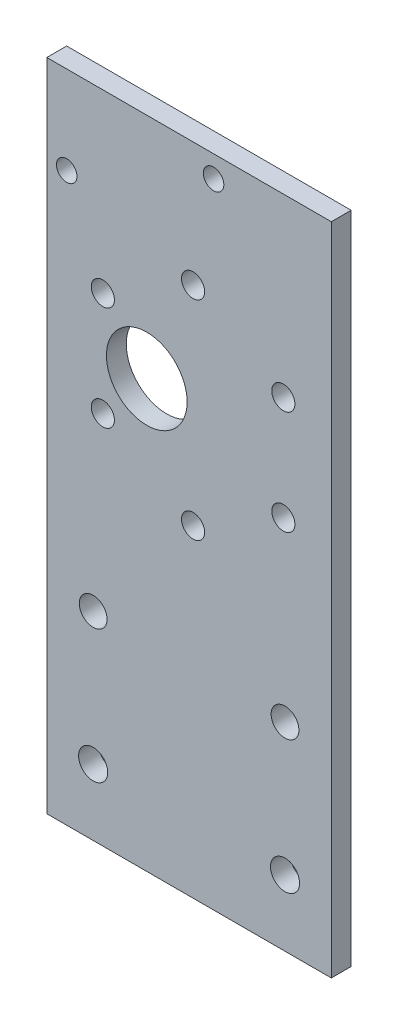
ISO-10303-21;
HEADER;
FILE_DESCRIPTION(('STEP AP214'),'2;1');
FILE_NAME('part.step','',(''),(''),'','','');
FILE_SCHEMA(('AUTOMOTIVE_DESIGN { 1 0 10303 214 1 1 1 1 }'));
ENDSEC;
DATA;
#1=APPLICATION_CONTEXT('core data for automotive mechanical design processes');
#2=APPLICATION_PROTOCOL_DEFINITION('international standard','automotive_design',2000,#1);
#3=PRODUCT_CONTEXT('',#1,'mechanical');
#4=PRODUCT('Part','Part','',(#3));
#5=PRODUCT_RELATED_PRODUCT_CATEGORY('part','',(#4));
#6=PRODUCT_DEFINITION_FORMATION('','',#4);
#7=PRODUCT_DEFINITION_CONTEXT('part definition',#1,'design');
#8=PRODUCT_DEFINITION('design','',#6,#7);
#9=PRODUCT_DEFINITION_SHAPE('','',#8);
#10=(LENGTH_UNIT() NAMED_UNIT(*) SI_UNIT(.MILLI.,.METRE.));
#11=(NAMED_UNIT(*) PLANE_ANGLE_UNIT() SI_UNIT($,.RADIAN.));
#12=(NAMED_UNIT(*) SI_UNIT($,.STERADIAN.) SOLID_ANGLE_UNIT());
#13=UNCERTAINTY_MEASURE_WITH_UNIT(LENGTH_MEASURE(1.E-05),#10,'distance_accuracy_value','');
#14=(GEOMETRIC_REPRESENTATION_CONTEXT(3) GLOBAL_UNCERTAINTY_ASSIGNED_CONTEXT((#13)) GLOBAL_UNIT_ASSIGNED_CONTEXT((#10,
#11,#12)) REPRESENTATION_CONTEXT('',''));
#15=CARTESIAN_POINT('',(0.,0.,0.));
#16=DIRECTION('',(0.,0.,1.));
#17=DIRECTION('',(1.,0.,0.));
#18=AXIS2_PLACEMENT_3D('',#15,#16,#17);
#19=CARTESIAN_POINT('',(0.,0.,3.));
#20=DIRECTION('',(0.,0.,1.));
#21=DIRECTION('',(1.,0.,0.));
#22=AXIS2_PLACEMENT_3D('',#19,#20,#21);
#23=PLANE('',#22);
#24=CARTESIAN_POINT('',(24.,21.2,3.));
#25=DIRECTION('',(0.,0.,1.));
#26=DIRECTION('',(1.,0.,0.));
#27=AXIS2_PLACEMENT_3D('',#24,#25,#26);
#28=CIRCLE('',#27,1.55);
#29=CARTESIAN_POINT('',(25.55,21.2,3.));
#30=VERTEX_POINT('',#29);
#31=EDGE_CURVE('E230',#30,#30,#28,.T.);
#32=ORIENTED_EDGE('',*,*,#31,.F.);
#33=EDGE_LOOP('',(#32));
#34=FACE_BOUND('',#33,.T.);
#35=CARTESIAN_POINT('',(46.2,31.2,3.));
#36=DIRECTION('',(0.,0.,1.));
#37=DIRECTION('',(1.,0.,0.));
#38=AXIS2_PLACEMENT_3D('',#35,#36,#37);
#39=CIRCLE('',#38,1.55);
#40=CARTESIAN_POINT('',(47.75,31.2,3.));
#41=VERTEX_POINT('',#40);
#42=EDGE_CURVE('E119',#41,#41,#39,.T.);
#43=ORIENTED_EDGE('',*,*,#42,.F.);
#44=EDGE_LOOP('',(#43));
#45=FACE_BOUND('',#44,.T.);
#46=CARTESIAN_POINT('',(28.,-54.5,3.));
#47=DIRECTION('',(0.,0.,1.));
#48=DIRECTION('',(1.,0.,0.));
#49=AXIS2_PLACEMENT_3D('',#46,#47,#48);
#50=CIRCLE('',#49,2.2);
#51=CARTESIAN_POINT('',(30.2,-54.5,3.));
#52=VERTEX_POINT('',#51);
#53=EDGE_CURVE('E127',#52,#52,#50,.T.);
#54=ORIENTED_EDGE('',*,*,#53,.F.);
#55=EDGE_LOOP('',(#54));
#56=FACE_BOUND('',#55,.T.);
#57=CARTESIAN_POINT('',(57.,-54.5,3.));
#58=DIRECTION('',(0.,0.,1.));
#59=DIRECTION('',(1.,0.,0.));
#60=AXIS2_PLACEMENT_3D('',#57,#58,#59);
#61=CIRCLE('',#60,2.2);
#62=CARTESIAN_POINT('',(59.2,-54.5,3.));
#63=VERTEX_POINT('',#62);
#64=EDGE_CURVE('E126',#63,#63,#61,.T.);
#65=ORIENTED_EDGE('',*,*,#64,.F.);
#66=EDGE_LOOP('',(#65));
#67=FACE_BOUND('',#66,.T.);
#68=DIRECTION('',(0.,-1.,0.));
#69=VECTOR('',#68,1.);
#70=CARTESIAN_POINT('',(64.,24.5,3.));
#71=LINE('',#70,#69);
#72=CARTESIAN_POINT('',(64.,34.5,3.));
#73=VERTEX_POINT('',#72);
#74=CARTESIAN_POINT('',(64.,-64.5,3.));
#75=VERTEX_POINT('',#74);
#76=EDGE_CURVE('E12',#73,#75,#71,.T.);
#77=ORIENTED_EDGE('',*,*,#76,.F.);
#78=DIRECTION('',(1.,0.,0.));
#79=VECTOR('',#78,1.);
#80=CARTESIAN_POINT('',(21.,34.5,3.));
#81=LINE('',#80,#79);
#82=CARTESIAN_POINT('',(21.,34.5,3.));
#83=VERTEX_POINT('',#82);
#84=EDGE_CURVE('E102',#83,#73,#81,.T.);
#85=ORIENTED_EDGE('',*,*,#84,.F.);
#86=DIRECTION('',(0.,1.,0.));
#87=VECTOR('',#86,1.);
#88=CARTESIAN_POINT('',(21.,-34.5,3.));
#89=LINE('',#88,#87);
#90=CARTESIAN_POINT('',(21.,-64.5,3.));
#91=VERTEX_POINT('',#90);
#92=EDGE_CURVE('E89',#91,#83,#89,.T.);
#93=ORIENTED_EDGE('',*,*,#92,.F.);
#94=DIRECTION('',(-1.,0.,0.));
#95=VECTOR('',#94,1.);
#96=CARTESIAN_POINT('',(64.,-64.5,3.));
#97=LINE('',#96,#95);
#98=EDGE_CURVE('E139',#75,#91,#97,.T.);
#99=ORIENTED_EDGE('',*,*,#98,.F.);
#100=EDGE_LOOP('',(#77,#85,#93,#99));
#101=FACE_BOUND('',#100,.T.);
#102=CARTESIAN_POINT('',(28.,-34.5,3.));
#103=DIRECTION('',(0.,0.,1.));
#104=DIRECTION('',(1.,0.,0.));
#105=AXIS2_PLACEMENT_3D('',#102,#103,#104);
#106=CIRCLE('',#105,2.1);
#107=CARTESIAN_POINT('',(30.1,-34.5,3.));
#108=VERTEX_POINT('',#107);
#109=EDGE_CURVE('E149',#108,#108,#106,.T.);
#110=ORIENTED_EDGE('',*,*,#109,.F.);
#111=EDGE_LOOP('',(#110));
#112=FACE_BOUND('',#111,.T.);
#113=CARTESIAN_POINT('',(57.,-34.5,3.));
#114=DIRECTION('',(0.,0.,1.));
#115=DIRECTION('',(1.,0.,0.));
#116=AXIS2_PLACEMENT_3D('',#113,#114,#115);
#117=CIRCLE('',#116,2.1);
#118=CARTESIAN_POINT('',(59.1,-34.5,3.));
#119=VERTEX_POINT('',#118);
#120=EDGE_CURVE('E148',#119,#119,#117,.T.);
#121=ORIENTED_EDGE('',*,*,#120,.F.);
#122=EDGE_LOOP('',(#121));
#123=FACE_BOUND('',#122,.T.);
#124=CARTESIAN_POINT('',(29.4658977502798,-7.87499999999997,3.));
#125=DIRECTION('',(0.,0.,1.));
#126=DIRECTION('',(1.,0.,0.));
#127=AXIS2_PLACEMENT_3D('',#124,#125,#126);
#128=CIRCLE('',#127,1.75);
#129=CARTESIAN_POINT('',(31.2158977502798,-7.87499999999997,3.));
#130=VERTEX_POINT('',#129);
#131=EDGE_CURVE('E164',#130,#130,#128,.T.);
#132=ORIENTED_EDGE('',*,*,#131,.F.);
#133=EDGE_LOOP('',(#132));
#134=FACE_BOUND('',#133,.T.);
#135=CARTESIAN_POINT('',(43.1057978598848,-15.75,3.));
#136=DIRECTION('',(0.,0.,1.));
#137=DIRECTION('',(1.,0.,0.));
#138=AXIS2_PLACEMENT_3D('',#135,#136,#137);
#139=CIRCLE('',#138,1.75);
#140=CARTESIAN_POINT('',(44.8557978598848,-15.75,3.));
#141=VERTEX_POINT('',#140);
#142=EDGE_CURVE('E160',#141,#141,#139,.T.);
#143=ORIENTED_EDGE('',*,*,#142,.F.);
#144=EDGE_LOOP('',(#143));
#145=FACE_BOUND('',#144,.T.);
#146=CARTESIAN_POINT('',(36.1057978598848,0.,3.));
#147=DIRECTION('',(0.,0.,1.));
#148=DIRECTION('',(1.,0.,0.));
#149=AXIS2_PLACEMENT_3D('',#146,#147,#148);
#150=CIRCLE('',#149,6.1);
#151=CARTESIAN_POINT('',(42.2057978598848,0.,3.));
#152=VERTEX_POINT('',#151);
#153=EDGE_CURVE('E165',#152,#152,#150,.T.);
#154=ORIENTED_EDGE('',*,*,#153,.F.);
#155=EDGE_LOOP('',(#154));
#156=FACE_BOUND('',#155,.T.);
#157=CARTESIAN_POINT('',(29.4658977502798,7.87499999999996,3.));
#158=DIRECTION('',(0.,0.,1.));
#159=DIRECTION('',(1.,0.,0.));
#160=AXIS2_PLACEMENT_3D('',#157,#158,#159);
#161=CIRCLE('',#160,1.75);
#162=CARTESIAN_POINT('',(31.2158977502798,7.87499999999996,3.));
#163=VERTEX_POINT('',#162);
#164=EDGE_CURVE('E169',#163,#163,#161,.T.);
#165=ORIENTED_EDGE('',*,*,#164,.F.);
#166=EDGE_LOOP('',(#165));
#167=FACE_BOUND('',#166,.T.);
#168=CARTESIAN_POINT('',(43.1057978598848,15.75,3.));
#169=DIRECTION('',(0.,0.,1.));
#170=DIRECTION('',(1.,0.,0.));
#171=AXIS2_PLACEMENT_3D('',#168,#169,#170);
#172=CIRCLE('',#171,1.75);
#173=CARTESIAN_POINT('',(44.8557978598848,15.75,3.));
#174=VERTEX_POINT('',#173);
#175=EDGE_CURVE('E173',#174,#174,#172,.T.);
#176=ORIENTED_EDGE('',*,*,#175,.F.);
#177=EDGE_LOOP('',(#176));
#178=FACE_BOUND('',#177,.T.);
#179=CARTESIAN_POINT('',(56.7456979694897,7.87499999999997,3.));
#180=DIRECTION('',(0.,0.,1.));
#181=DIRECTION('',(1.,0.,0.));
#182=AXIS2_PLACEMENT_3D('',#179,#180,#181);
#183=CIRCLE('',#182,1.75);
#184=CARTESIAN_POINT('',(58.4956979694897,7.87499999999997,3.));
#185=VERTEX_POINT('',#184);
#186=EDGE_CURVE('E177',#185,#185,#183,.T.);
#187=ORIENTED_EDGE('',*,*,#186,.F.);
#188=EDGE_LOOP('',(#187));
#189=FACE_BOUND('',#188,.T.);
#190=CARTESIAN_POINT('',(56.7456979694897,-7.87499999999997,3.));
#191=DIRECTION('',(0.,0.,1.));
#192=DIRECTION('',(1.,0.,0.));
#193=AXIS2_PLACEMENT_3D('',#190,#191,#192);
#194=CIRCLE('',#193,1.75);
#195=CARTESIAN_POINT('',(58.4956979694897,-7.87499999999997,3.));
#196=VERTEX_POINT('',#195);
#197=EDGE_CURVE('E159',#196,#196,#194,.T.);
#198=ORIENTED_EDGE('',*,*,#197,.F.);
#199=EDGE_LOOP('',(#198));
#200=FACE_BOUND('',#199,.T.);
#201=ADVANCED_FACE('F48',(#34,#45,#56,#67,#101,#112,#123,#134,#145,#156,#167,#178,#189,#200),
#23,.T.);
#202=CARTESIAN_POINT('',(0.,0.,0.));
#203=DIRECTION('',(0.,0.,1.));
#204=DIRECTION('',(1.,0.,0.));
#205=AXIS2_PLACEMENT_3D('',#202,#203,#204);
#206=PLANE('',#205);
#207=CARTESIAN_POINT('',(24.,21.2,0.));
#208=DIRECTION('',(0.,0.,1.));
#209=DIRECTION('',(1.,0.,0.));
#210=AXIS2_PLACEMENT_3D('',#207,#208,#209);
#211=CIRCLE('',#210,1.55);
#212=CARTESIAN_POINT('',(25.55,21.2,0.));
#213=VERTEX_POINT('',#212);
#214=EDGE_CURVE('E52',#213,#213,#211,.T.);
#215=ORIENTED_EDGE('',*,*,#214,.T.);
#216=EDGE_LOOP('',(#215));
#217=FACE_BOUND('',#216,.T.);
#218=CARTESIAN_POINT('',(46.2,31.2,0.));
#219=DIRECTION('',(0.,0.,1.));
#220=DIRECTION('',(1.,0.,0.));
#221=AXIS2_PLACEMENT_3D('',#218,#219,#220);
#222=CIRCLE('',#221,1.55);
#223=CARTESIAN_POINT('',(47.75,31.2,0.));
#224=VERTEX_POINT('',#223);
#225=EDGE_CURVE('E117',#224,#224,#222,.T.);
#226=ORIENTED_EDGE('',*,*,#225,.T.);
#227=EDGE_LOOP('',(#226));
#228=FACE_BOUND('',#227,.T.);
#229=CARTESIAN_POINT('',(28.,-54.5,0.));
#230=DIRECTION('',(0.,0.,1.));
#231=DIRECTION('',(1.,0.,0.));
#232=AXIS2_PLACEMENT_3D('',#229,#230,#231);
#233=CIRCLE('',#232,2.2);
#234=CARTESIAN_POINT('',(30.2,-54.5,0.));
#235=VERTEX_POINT('',#234);
#236=EDGE_CURVE('E140',#235,#235,#233,.T.);
#237=ORIENTED_EDGE('',*,*,#236,.T.);
#238=EDGE_LOOP('',(#237));
#239=FACE_BOUND('',#238,.T.);
#240=CARTESIAN_POINT('',(57.,-54.5,0.));
#241=DIRECTION('',(0.,0.,1.));
#242=DIRECTION('',(1.,0.,0.));
#243=AXIS2_PLACEMENT_3D('',#240,#241,#242);
#244=CIRCLE('',#243,2.2);
#245=CARTESIAN_POINT('',(59.2,-54.5,0.));
#246=VERTEX_POINT('',#245);
#247=EDGE_CURVE('E131',#246,#246,#244,.T.);
#248=ORIENTED_EDGE('',*,*,#247,.T.);
#249=EDGE_LOOP('',(#248));
#250=FACE_BOUND('',#249,.T.);
#251=CARTESIAN_POINT('',(28.,-34.5,0.));
#252=DIRECTION('',(0.,0.,1.));
#253=DIRECTION('',(1.,0.,0.));
#254=AXIS2_PLACEMENT_3D('',#251,#252,#253);
#255=CIRCLE('',#254,2.1);
#256=CARTESIAN_POINT('',(30.1,-34.5,0.));
#257=VERTEX_POINT('',#256);
#258=EDGE_CURVE('E99',#257,#257,#255,.T.);
#259=ORIENTED_EDGE('',*,*,#258,.T.);
#260=EDGE_LOOP('',(#259));
#261=FACE_BOUND('',#260,.T.);
#262=CARTESIAN_POINT('',(57.,-34.5,0.));
#263=DIRECTION('',(0.,0.,1.));
#264=DIRECTION('',(1.,0.,0.));
#265=AXIS2_PLACEMENT_3D('',#262,#263,#264);
#266=CIRCLE('',#265,2.1);
#267=CARTESIAN_POINT('',(59.1,-34.5,0.));
#268=VERTEX_POINT('',#267);
#269=EDGE_CURVE('E153',#268,#268,#266,.T.);
#270=ORIENTED_EDGE('',*,*,#269,.T.);
#271=EDGE_LOOP('',(#270));
#272=FACE_BOUND('',#271,.T.);
#273=CARTESIAN_POINT('',(29.4658977502798,-7.87499999999997,0.));
#274=DIRECTION('',(0.,0.,1.));
#275=DIRECTION('',(1.,0.,0.));
#276=AXIS2_PLACEMENT_3D('',#273,#274,#275);
#277=CIRCLE('',#276,1.75);
#278=CARTESIAN_POINT('',(31.2158977502798,-7.87499999999997,0.));
#279=VERTEX_POINT('',#278);
#280=EDGE_CURVE('E187',#279,#279,#277,.T.);
#281=ORIENTED_EDGE('',*,*,#280,.T.);
#282=EDGE_LOOP('',(#281));
#283=FACE_BOUND('',#282,.T.);
#284=CARTESIAN_POINT('',(43.1057978598848,-15.75,0.));
#285=DIRECTION('',(0.,0.,1.));
#286=DIRECTION('',(1.,0.,0.));
#287=AXIS2_PLACEMENT_3D('',#284,#285,#286);
#288=CIRCLE('',#287,1.75);
#289=CARTESIAN_POINT('',(44.8557978598848,-15.75,0.));
#290=VERTEX_POINT('',#289);
#291=EDGE_CURVE('E194',#290,#290,#288,.T.);
#292=ORIENTED_EDGE('',*,*,#291,.T.);
#293=EDGE_LOOP('',(#292));
#294=FACE_BOUND('',#293,.T.);
#295=CARTESIAN_POINT('',(36.1057978598848,0.,0.));
#296=DIRECTION('',(0.,0.,1.));
#297=DIRECTION('',(1.,0.,0.));
#298=AXIS2_PLACEMENT_3D('',#295,#296,#297);
#299=CIRCLE('',#298,6.1);
#300=CARTESIAN_POINT('',(42.2057978598848,0.,0.));
#301=VERTEX_POINT('',#300);
#302=EDGE_CURVE('E198',#301,#301,#299,.T.);
#303=ORIENTED_EDGE('',*,*,#302,.T.);
#304=EDGE_LOOP('',(#303));
#305=FACE_BOUND('',#304,.T.);
#306=CARTESIAN_POINT('',(29.4658977502798,7.87499999999996,0.));
#307=DIRECTION('',(0.,0.,1.));
#308=DIRECTION('',(1.,0.,0.));
#309=AXIS2_PLACEMENT_3D('',#306,#307,#308);
#310=CIRCLE('',#309,1.75);
#311=CARTESIAN_POINT('',(31.2158977502798,7.87499999999996,0.));
#312=VERTEX_POINT('',#311);
#313=EDGE_CURVE('E202',#312,#312,#310,.T.);
#314=ORIENTED_EDGE('',*,*,#313,.T.);
#315=EDGE_LOOP('',(#314));
#316=FACE_BOUND('',#315,.T.);
#317=CARTESIAN_POINT('',(43.1057978598848,15.75,0.));
#318=DIRECTION('',(0.,0.,1.));
#319=DIRECTION('',(1.,0.,0.));
#320=AXIS2_PLACEMENT_3D('',#317,#318,#319);
#321=CIRCLE('',#320,1.75);
#322=CARTESIAN_POINT('',(44.8557978598848,15.75,0.));
#323=VERTEX_POINT('',#322);
#324=EDGE_CURVE('E206',#323,#323,#321,.T.);
#325=ORIENTED_EDGE('',*,*,#324,.T.);
#326=EDGE_LOOP('',(#325));
#327=FACE_BOUND('',#326,.T.);
#328=CARTESIAN_POINT('',(56.7456979694897,7.87499999999997,0.));
#329=DIRECTION('',(0.,0.,1.));
#330=DIRECTION('',(1.,0.,0.));
#331=AXIS2_PLACEMENT_3D('',#328,#329,#330);
#332=CIRCLE('',#331,1.75);
#333=CARTESIAN_POINT('',(58.4956979694897,7.87499999999997,0.));
#334=VERTEX_POINT('',#333);
#335=EDGE_CURVE('E210',#334,#334,#332,.T.);
#336=ORIENTED_EDGE('',*,*,#335,.T.);
#337=EDGE_LOOP('',(#336));
#338=FACE_BOUND('',#337,.T.);
#339=CARTESIAN_POINT('',(56.7456979694897,-7.87499999999997,0.));
#340=DIRECTION('',(0.,0.,1.));
#341=DIRECTION('',(1.,0.,0.));
#342=AXIS2_PLACEMENT_3D('',#339,#340,#341);
#343=CIRCLE('',#342,1.75);
#344=CARTESIAN_POINT('',(58.4956979694897,-7.87499999999997,0.));
#345=VERTEX_POINT('',#344);
#346=EDGE_CURVE('E189',#345,#345,#343,.T.);
#347=ORIENTED_EDGE('',*,*,#346,.T.);
#348=EDGE_LOOP('',(#347));
#349=FACE_BOUND('',#348,.T.);
#350=DIRECTION('',(0.,-1.,0.));
#351=VECTOR('',#350,1.);
#352=CARTESIAN_POINT('',(21.,-34.5,0.));
#353=LINE('',#352,#351);
#354=CARTESIAN_POINT('',(21.,34.5,0.));
#355=VERTEX_POINT('',#354);
#356=CARTESIAN_POINT('',(21.,-64.5,0.));
#357=VERTEX_POINT('',#356);
#358=EDGE_CURVE('E73',#355,#357,#353,.T.);
#359=ORIENTED_EDGE('',*,*,#358,.F.);
#360=DIRECTION('',(-1.,0.,0.));
#361=VECTOR('',#360,1.);
#362=CARTESIAN_POINT('',(21.,34.5,0.));
#363=LINE('',#362,#361);
#364=CARTESIAN_POINT('',(64.,34.5,0.));
#365=VERTEX_POINT('',#364);
#366=EDGE_CURVE('E112',#365,#355,#363,.T.);
#367=ORIENTED_EDGE('',*,*,#366,.F.);
#368=DIRECTION('',(0.,1.,0.));
#369=VECTOR('',#368,1.);
#370=CARTESIAN_POINT('',(64.,24.5,0.));
#371=LINE('',#370,#369);
#372=CARTESIAN_POINT('',(64.,-64.5,0.));
#373=VERTEX_POINT('',#372);
#374=EDGE_CURVE('E58',#373,#365,#371,.T.);
#375=ORIENTED_EDGE('',*,*,#374,.F.);
#376=DIRECTION('',(1.,0.,0.));
#377=VECTOR('',#376,1.);
#378=CARTESIAN_POINT('',(64.,-64.5,0.));
#379=LINE('',#378,#377);
#380=EDGE_CURVE('E145',#357,#373,#379,.T.);
#381=ORIENTED_EDGE('',*,*,#380,.F.);
#382=EDGE_LOOP('',(#359,#367,#375,#381));
#383=FACE_BOUND('',#382,.T.);
#384=ADVANCED_FACE('F50',(#217,#228,#239,#250,#261,#272,#283,#294,#305,#316,#327,#338,#349,
#383),#206,.F.);
#385=CARTESIAN_POINT('',(64.,0.,0.));
#386=DIRECTION('',(-1.,0.,0.));
#387=DIRECTION('',(0.,0.,1.));
#388=AXIS2_PLACEMENT_3D('',#385,#386,#387);
#389=PLANE('',#388);
#390=ORIENTED_EDGE('',*,*,#374,.T.);
#391=DIRECTION('',(0.,0.,-1.));
#392=VECTOR('',#391,1.);
#393=CARTESIAN_POINT('',(64.,34.5,0.));
#394=LINE('',#393,#392);
#395=EDGE_CURVE('E108',#73,#365,#394,.T.);
#396=ORIENTED_EDGE('',*,*,#395,.F.);
#397=ORIENTED_EDGE('',*,*,#76,.T.);
#398=DIRECTION('',(0.,0.,1.));
#399=VECTOR('',#398,1.);
#400=CARTESIAN_POINT('',(64.,-64.5,0.));
#401=LINE('',#400,#399);
#402=EDGE_CURVE('E135',#373,#75,#401,.T.);
#403=ORIENTED_EDGE('',*,*,#402,.F.);
#404=EDGE_LOOP('',(#390,#396,#397,#403));
#405=FACE_BOUND('',#404,.T.);
#406=ADVANCED_FACE('F261',(#405),#389,.F.);
#407=CARTESIAN_POINT('',(29.4658977502798,-7.87499999999997,-7.));
#408=DIRECTION('',(0.,0.,1.));
#409=DIRECTION('',(1.,0.,0.));
#410=AXIS2_PLACEMENT_3D('',#407,#408,#409);
#411=CYLINDRICAL_SURFACE('',#410,1.75);
#412=ORIENTED_EDGE('',*,*,#131,.T.);
#413=EDGE_LOOP('',(#412));
#414=FACE_BOUND('',#413,.T.);
#415=ORIENTED_EDGE('',*,*,#280,.F.);
#416=EDGE_LOOP('',(#415));
#417=FACE_BOUND('',#416,.T.);
#418=ADVANCED_FACE('F284',(#414,#417),#411,.F.);
#419=CARTESIAN_POINT('',(43.1057978598848,-15.75,-7.));
#420=DIRECTION('',(0.,0.,1.));
#421=DIRECTION('',(1.,0.,0.));
#422=AXIS2_PLACEMENT_3D('',#419,#420,#421);
#423=CYLINDRICAL_SURFACE('',#422,1.75);
#424=ORIENTED_EDGE('',*,*,#142,.T.);
#425=EDGE_LOOP('',(#424));
#426=FACE_BOUND('',#425,.T.);
#427=ORIENTED_EDGE('',*,*,#291,.F.);
#428=EDGE_LOOP('',(#427));
#429=FACE_BOUND('',#428,.T.);
#430=ADVANCED_FACE('F290',(#426,#429),#423,.F.);
#431=CARTESIAN_POINT('',(36.1057978598848,0.,-7.));
#432=DIRECTION('',(0.,0.,1.));
#433=DIRECTION('',(1.,0.,0.));
#434=AXIS2_PLACEMENT_3D('',#431,#432,#433);
#435=CYLINDRICAL_SURFACE('',#434,6.1);
#436=ORIENTED_EDGE('',*,*,#153,.T.);
#437=EDGE_LOOP('',(#436));
#438=FACE_BOUND('',#437,.T.);
#439=ORIENTED_EDGE('',*,*,#302,.F.);
#440=EDGE_LOOP('',(#439));
#441=FACE_BOUND('',#440,.T.);
#442=ADVANCED_FACE('F309',(#438,#441),#435,.F.);
#443=CARTESIAN_POINT('',(29.4658977502798,7.87499999999996,-7.));
#444=DIRECTION('',(0.,0.,1.));
#445=DIRECTION('',(1.,0.,0.));
#446=AXIS2_PLACEMENT_3D('',#443,#444,#445);
#447=CYLINDRICAL_SURFACE('',#446,1.75);
#448=ORIENTED_EDGE('',*,*,#164,.T.);
#449=EDGE_LOOP('',(#448));
#450=FACE_BOUND('',#449,.T.);
#451=ORIENTED_EDGE('',*,*,#313,.F.);
#452=EDGE_LOOP('',(#451));
#453=FACE_BOUND('',#452,.T.);
#454=ADVANCED_FACE('F305',(#450,#453),#447,.F.);
#455=CARTESIAN_POINT('',(43.1057978598848,15.75,-7.));
#456=DIRECTION('',(0.,0.,1.));
#457=DIRECTION('',(1.,0.,0.));
#458=AXIS2_PLACEMENT_3D('',#455,#456,#457);
#459=CYLINDRICAL_SURFACE('',#458,1.75);
#460=ORIENTED_EDGE('',*,*,#175,.T.);
#461=EDGE_LOOP('',(#460));
#462=FACE_BOUND('',#461,.T.);
#463=ORIENTED_EDGE('',*,*,#324,.F.);
#464=EDGE_LOOP('',(#463));
#465=FACE_BOUND('',#464,.T.);
#466=ADVANCED_FACE('F301',(#462,#465),#459,.F.);
#467=CARTESIAN_POINT('',(56.7456979694897,7.87499999999997,-7.));
#468=DIRECTION('',(0.,0.,1.));
#469=DIRECTION('',(1.,0.,0.));
#470=AXIS2_PLACEMENT_3D('',#467,#468,#469);
#471=CYLINDRICAL_SURFACE('',#470,1.75);
#472=ORIENTED_EDGE('',*,*,#186,.T.);
#473=EDGE_LOOP('',(#472));
#474=FACE_BOUND('',#473,.T.);
#475=ORIENTED_EDGE('',*,*,#335,.F.);
#476=EDGE_LOOP('',(#475));
#477=FACE_BOUND('',#476,.T.);
#478=ADVANCED_FACE('F297',(#474,#477),#471,.F.);
#479=CARTESIAN_POINT('',(56.7456979694897,-7.87499999999997,-7.));
#480=DIRECTION('',(0.,0.,1.));
#481=DIRECTION('',(1.,0.,0.));
#482=AXIS2_PLACEMENT_3D('',#479,#480,#481);
#483=CYLINDRICAL_SURFACE('',#482,1.75);
#484=ORIENTED_EDGE('',*,*,#197,.T.);
#485=EDGE_LOOP('',(#484));
#486=FACE_BOUND('',#485,.T.);
#487=ORIENTED_EDGE('',*,*,#346,.F.);
#488=EDGE_LOOP('',(#487));
#489=FACE_BOUND('',#488,.T.);
#490=ADVANCED_FACE('F294',(#486,#489),#483,.F.);
#491=CARTESIAN_POINT('',(21.,0.,0.));
#492=DIRECTION('',(-1.,0.,0.));
#493=DIRECTION('',(0.,-1.,0.));
#494=AXIS2_PLACEMENT_3D('',#491,#492,#493);
#495=PLANE('',#494);
#496=ORIENTED_EDGE('',*,*,#92,.T.);
#497=DIRECTION('',(0.,0.,1.));
#498=VECTOR('',#497,1.);
#499=CARTESIAN_POINT('',(21.,34.5,0.));
#500=LINE('',#499,#498);
#501=EDGE_CURVE('E93',#355,#83,#500,.T.);
#502=ORIENTED_EDGE('',*,*,#501,.F.);
#503=ORIENTED_EDGE('',*,*,#358,.T.);
#504=DIRECTION('',(0.,0.,-1.));
#505=VECTOR('',#504,1.);
#506=CARTESIAN_POINT('',(21.,-64.5,0.));
#507=LINE('',#506,#505);
#508=EDGE_CURVE('E94',#91,#357,#507,.T.);
#509=ORIENTED_EDGE('',*,*,#508,.F.);
#510=EDGE_LOOP('',(#496,#502,#503,#509));
#511=FACE_BOUND('',#510,.T.);
#512=ADVANCED_FACE('F91',(#511),#495,.T.);
#513=CARTESIAN_POINT('',(57.,-34.5,-7.));
#514=DIRECTION('',(0.,0.,1.));
#515=DIRECTION('',(1.,0.,0.));
#516=AXIS2_PLACEMENT_3D('',#513,#514,#515);
#517=CYLINDRICAL_SURFACE('',#516,2.1);
#518=ORIENTED_EDGE('',*,*,#120,.T.);
#519=EDGE_LOOP('',(#518));
#520=FACE_BOUND('',#519,.T.);
#521=ORIENTED_EDGE('',*,*,#269,.F.);
#522=EDGE_LOOP('',(#521));
#523=FACE_BOUND('',#522,.T.);
#524=ADVANCED_FACE('F318',(#520,#523),#517,.F.);
#525=CARTESIAN_POINT('',(28.,-34.5,-7.));
#526=DIRECTION('',(0.,0.,1.));
#527=DIRECTION('',(1.,0.,0.));
#528=AXIS2_PLACEMENT_3D('',#525,#526,#527);
#529=CYLINDRICAL_SURFACE('',#528,2.1);
#530=ORIENTED_EDGE('',*,*,#109,.T.);
#531=EDGE_LOOP('',(#530));
#532=FACE_BOUND('',#531,.T.);
#533=ORIENTED_EDGE('',*,*,#258,.F.);
#534=EDGE_LOOP('',(#533));
#535=FACE_BOUND('',#534,.T.);
#536=ADVANCED_FACE('F321',(#532,#535),#529,.F.);
#537=CARTESIAN_POINT('',(0.,-64.5,0.));
#538=DIRECTION('',(0.,-1.,0.));
#539=DIRECTION('',(0.,0.,-1.));
#540=AXIS2_PLACEMENT_3D('',#537,#538,#539);
#541=PLANE('',#540);
#542=ORIENTED_EDGE('',*,*,#402,.T.);
#543=ORIENTED_EDGE('',*,*,#98,.T.);
#544=ORIENTED_EDGE('',*,*,#508,.T.);
#545=ORIENTED_EDGE('',*,*,#380,.T.);
#546=EDGE_LOOP('',(#542,#543,#544,#545));
#547=FACE_BOUND('',#546,.T.);
#548=ADVANCED_FACE('F255',(#547),#541,.T.);
#549=CARTESIAN_POINT('',(57.,-54.5,-7.));
#550=DIRECTION('',(0.,0.,1.));
#551=DIRECTION('',(1.,0.,0.));
#552=AXIS2_PLACEMENT_3D('',#549,#550,#551);
#553=CYLINDRICAL_SURFACE('',#552,2.2);
#554=ORIENTED_EDGE('',*,*,#64,.T.);
#555=EDGE_LOOP('',(#554));
#556=FACE_BOUND('',#555,.T.);
#557=ORIENTED_EDGE('',*,*,#247,.F.);
#558=EDGE_LOOP('',(#557));
#559=FACE_BOUND('',#558,.T.);
#560=ADVANCED_FACE('F251',(#556,#559),#553,.F.);
#561=CARTESIAN_POINT('',(28.,-54.5,-7.));
#562=DIRECTION('',(0.,0.,1.));
#563=DIRECTION('',(1.,0.,0.));
#564=AXIS2_PLACEMENT_3D('',#561,#562,#563);
#565=CYLINDRICAL_SURFACE('',#564,2.2);
#566=ORIENTED_EDGE('',*,*,#53,.T.);
#567=EDGE_LOOP('',(#566));
#568=FACE_BOUND('',#567,.T.);
#569=ORIENTED_EDGE('',*,*,#236,.F.);
#570=EDGE_LOOP('',(#569));
#571=FACE_BOUND('',#570,.T.);
#572=ADVANCED_FACE('F254',(#568,#571),#565,.F.);
#573=CARTESIAN_POINT('',(0.,34.5,0.));
#574=DIRECTION('',(0.,1.,0.));
#575=DIRECTION('',(0.,0.,1.));
#576=AXIS2_PLACEMENT_3D('',#573,#574,#575);
#577=PLANE('',#576);
#578=ORIENTED_EDGE('',*,*,#501,.T.);
#579=ORIENTED_EDGE('',*,*,#84,.T.);
#580=ORIENTED_EDGE('',*,*,#395,.T.);
#581=ORIENTED_EDGE('',*,*,#366,.T.);
#582=EDGE_LOOP('',(#578,#579,#580,#581));
#583=FACE_BOUND('',#582,.T.);
#584=ADVANCED_FACE('F111',(#583),#577,.T.);
#585=CARTESIAN_POINT('',(46.2,31.2,-7.));
#586=DIRECTION('',(0.,0.,1.));
#587=DIRECTION('',(1.,0.,0.));
#588=AXIS2_PLACEMENT_3D('',#585,#586,#587);
#589=CYLINDRICAL_SURFACE('',#588,1.55);
#590=ORIENTED_EDGE('',*,*,#42,.T.);
#591=EDGE_LOOP('',(#590));
#592=FACE_BOUND('',#591,.T.);
#593=ORIENTED_EDGE('',*,*,#225,.F.);
#594=EDGE_LOOP('',(#593));
#595=FACE_BOUND('',#594,.T.);
#596=ADVANCED_FACE('F241',(#592,#595),#589,.F.);
#597=CARTESIAN_POINT('',(24.,21.2,-7.));
#598=DIRECTION('',(0.,0.,1.));
#599=DIRECTION('',(1.,0.,0.));
#600=AXIS2_PLACEMENT_3D('',#597,#598,#599);
#601=CYLINDRICAL_SURFACE('',#600,1.55);
#602=ORIENTED_EDGE('',*,*,#31,.T.);
#603=EDGE_LOOP('',(#602));
#604=FACE_BOUND('',#603,.T.);
#605=ORIENTED_EDGE('',*,*,#214,.F.);
#606=EDGE_LOOP('',(#605));
#607=FACE_BOUND('',#606,.T.);
#608=ADVANCED_FACE('F335',(#604,#607),#601,.F.);
#609=CLOSED_SHELL('',(#201,#384,#406,#418,#430,#442,#454,#466,#478,#490,#512,#524,#536,#548,
#560,#572,#584,#596,#608));
#610=MANIFOLD_SOLID_BREP('B2',#609);
#611=ADVANCED_BREP_SHAPE_REPRESENTATION('',(#18,#610),#14);
#612=SHAPE_DEFINITION_REPRESENTATION(#9,#611);
ENDSEC;
END-ISO-10303-21;
